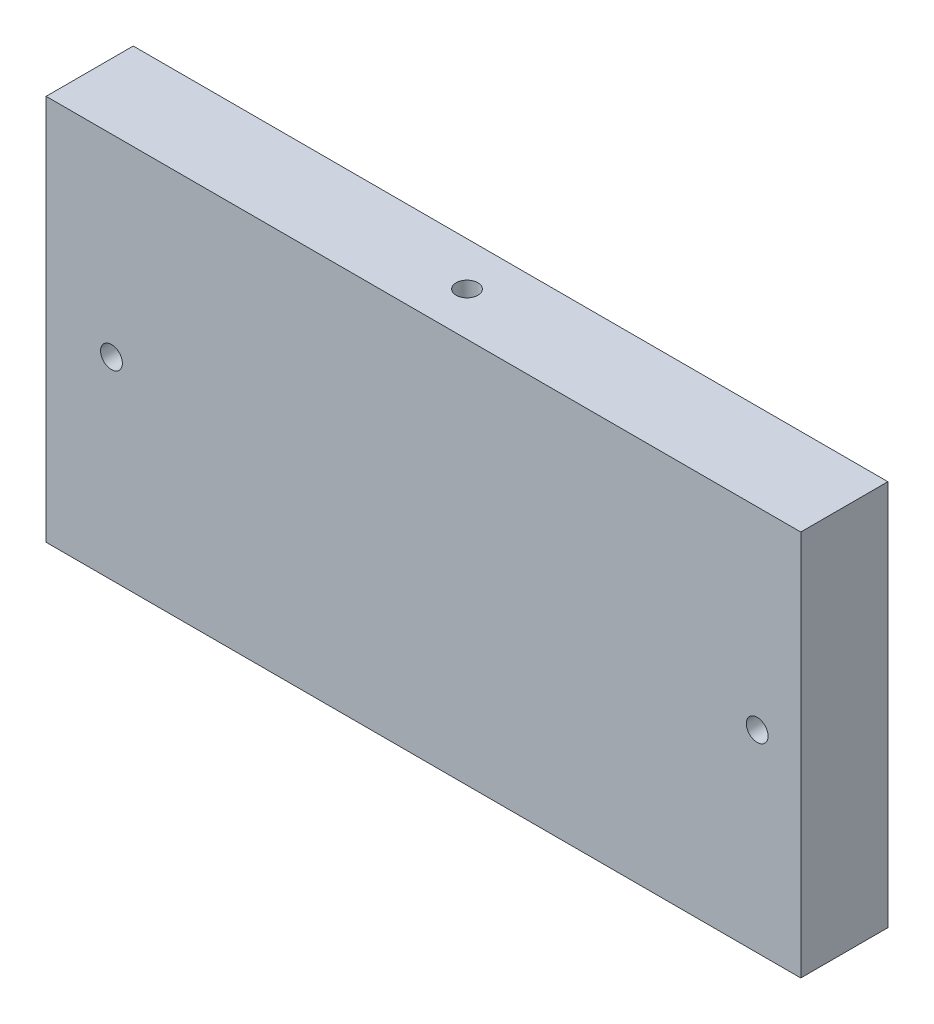
ISO-10303-21;
HEADER;
FILE_DESCRIPTION(('STEP AP214'),'2;1');
FILE_NAME('part.step','',(''),(''),'','','');
FILE_SCHEMA(('AUTOMOTIVE_DESIGN { 1 0 10303 214 1 1 1 1 }'));
ENDSEC;
DATA;
#1=APPLICATION_CONTEXT('core data for automotive mechanical design processes');
#2=APPLICATION_PROTOCOL_DEFINITION('international standard','automotive_design',2000,#1);
#3=PRODUCT_CONTEXT('',#1,'mechanical');
#4=PRODUCT('Part','Part','',(#3));
#5=PRODUCT_RELATED_PRODUCT_CATEGORY('part','',(#4));
#6=PRODUCT_DEFINITION_FORMATION('','',#4);
#7=PRODUCT_DEFINITION_CONTEXT('part definition',#1,'design');
#8=PRODUCT_DEFINITION('design','',#6,#7);
#9=PRODUCT_DEFINITION_SHAPE('','',#8);
#10=(LENGTH_UNIT() NAMED_UNIT(*) SI_UNIT(.MILLI.,.METRE.));
#11=(NAMED_UNIT(*) PLANE_ANGLE_UNIT() SI_UNIT($,.RADIAN.));
#12=(NAMED_UNIT(*) SI_UNIT($,.STERADIAN.) SOLID_ANGLE_UNIT());
#13=UNCERTAINTY_MEASURE_WITH_UNIT(LENGTH_MEASURE(1.E-05),#10,'distance_accuracy_value','');
#14=(GEOMETRIC_REPRESENTATION_CONTEXT(3) GLOBAL_UNCERTAINTY_ASSIGNED_CONTEXT((#13)) GLOBAL_UNIT_ASSIGNED_CONTEXT((#10,
#11,#12)) REPRESENTATION_CONTEXT('',''));
#15=CARTESIAN_POINT('',(0.,0.,0.));
#16=DIRECTION('',(0.,0.,1.));
#17=DIRECTION('',(1.,0.,0.));
#18=AXIS2_PLACEMENT_3D('',#15,#16,#17);
#19=CARTESIAN_POINT('',(-341.304465963193,69.0000000000062,12.699999999999));
#20=DIRECTION('',(0.,1.00000000000005,0.));
#21=DIRECTION('',(0.,0.,-1.00000000000002));
#22=AXIS2_PLACEMENT_3D('',#19,#20,#21);
#23=PLANE('',#22);
#24=CARTESIAN_POINT('',(-286.304465963193,69.0000000000062,6.34999999999853));
#25=DIRECTION('',(0.,-1.00000000000005,0.));
#26=DIRECTION('',(0.,0.,-1.00000000000002));
#27=AXIS2_PLACEMENT_3D('',#24,#25,#26);
#28=CIRCLE('',#27,1.58750000000002);
#29=CARTESIAN_POINT('',(-286.304465963193,69.0000000000062,4.76249999999847));
#30=VERTEX_POINT('',#29);
#31=EDGE_CURVE('E41',#30,#30,#28,.T.);
#32=ORIENTED_EDGE('',*,*,#31,.T.);
#33=EDGE_LOOP('',(#32));
#34=FACE_BOUND('',#33,.T.);
#35=DIRECTION('',(-1.,0.,0.));
#36=VECTOR('',#35,1.);
#37=CARTESIAN_POINT('',(-341.304465963192,69.0000000000071,-1.45890244329649E-12));
#38=LINE('',#37,#36);
#39=CARTESIAN_POINT('',(-231.304465963193,69.0000000000068,-1.24032728532342E-12));
#40=VERTEX_POINT('',#39);
#41=CARTESIAN_POINT('',(-341.304465963192,69.0000000000071,-1.45890244329649E-12));
#42=VERTEX_POINT('',#41);
#43=EDGE_CURVE('E125',#40,#42,#38,.T.);
#44=ORIENTED_EDGE('',*,*,#43,.T.);
#45=DIRECTION('',(0.,0.,-1.00000000000002));
#46=VECTOR('',#45,1.);
#47=CARTESIAN_POINT('',(-341.304465963193,69.0000000000062,12.699999999999));
#48=LINE('',#47,#46);
#49=CARTESIAN_POINT('',(-341.304465963193,69.0000000000062,12.699999999999));
#50=VERTEX_POINT('',#49);
#51=EDGE_CURVE('E124',#50,#42,#48,.T.);
#52=ORIENTED_EDGE('',*,*,#51,.F.);
#53=DIRECTION('',(-1.,0.,0.));
#54=VECTOR('',#53,1.);
#55=CARTESIAN_POINT('',(-341.304465963193,69.0000000000062,12.699999999999));
#56=LINE('',#55,#54);
#57=CARTESIAN_POINT('',(-231.304465963195,69.0000000000064,12.6999999999988));
#58=VERTEX_POINT('',#57);
#59=EDGE_CURVE('E118',#58,#50,#56,.T.);
#60=ORIENTED_EDGE('',*,*,#59,.F.);
#61=DIRECTION('',(0.,0.,-1.00000000000002));
#62=VECTOR('',#61,1.);
#63=CARTESIAN_POINT('',(-231.304465963195,69.0000000000064,12.6999999999988));
#64=LINE('',#63,#62);
#65=EDGE_CURVE('E11',#58,#40,#64,.T.);
#66=ORIENTED_EDGE('',*,*,#65,.T.);
#67=EDGE_LOOP('',(#44,#52,#60,#66));
#68=FACE_BOUND('',#67,.T.);
#69=ADVANCED_FACE('F38',(#34,#68),#23,.T.);
#70=CARTESIAN_POINT('',(-231.304465963195,12.7000000000036,12.7000000000004));
#71=DIRECTION('',(0.999999999999999,0.,0.));
#72=DIRECTION('',(0.,0.,1.00000000000002));
#73=AXIS2_PLACEMENT_3D('',#70,#71,#72);
#74=PLANE('',#73);
#75=DIRECTION('',(0.,1.00000000000005,0.));
#76=VECTOR('',#75,1.);
#77=CARTESIAN_POINT('',(-231.304465963193,12.7000000000006,-2.55004350968591E-13));
#78=LINE('',#77,#76);
#79=CARTESIAN_POINT('',(-231.304465963193,12.7000000000006,-2.55004350968591E-13));
#80=VERTEX_POINT('',#79);
#81=EDGE_CURVE('E80',#80,#40,#78,.T.);
#82=ORIENTED_EDGE('',*,*,#81,.T.);
#83=ORIENTED_EDGE('',*,*,#65,.F.);
#84=DIRECTION('',(0.,1.00000000000005,0.));
#85=VECTOR('',#84,1.);
#86=CARTESIAN_POINT('',(-231.304465963195,12.7000000000036,12.7000000000004));
#87=LINE('',#86,#85);
#88=CARTESIAN_POINT('',(-231.304465963195,12.7000000000036,12.7000000000004));
#89=VERTEX_POINT('',#88);
#90=EDGE_CURVE('E56',#89,#58,#87,.T.);
#91=ORIENTED_EDGE('',*,*,#90,.F.);
#92=DIRECTION('',(0.,0.,-1.00000000000002));
#93=VECTOR('',#92,1.);
#94=CARTESIAN_POINT('',(-231.304465963195,12.7000000000036,12.7000000000004));
#95=LINE('',#94,#93);
#96=EDGE_CURVE('E47',#89,#80,#95,.T.);
#97=ORIENTED_EDGE('',*,*,#96,.T.);
#98=EDGE_LOOP('',(#82,#83,#91,#97));
#99=FACE_BOUND('',#98,.T.);
#100=ADVANCED_FACE('F169',(#99),#74,.T.);
#101=CARTESIAN_POINT('',(-231.304465963195,12.7000000000036,12.7000000000004));
#102=DIRECTION('',(0.,-1.00000000000005,0.));
#103=DIRECTION('',(1.,0.,0.));
#104=AXIS2_PLACEMENT_3D('',#101,#102,#103);
#105=PLANE('',#104);
#106=DIRECTION('',(1.,0.,0.));
#107=VECTOR('',#106,1.);
#108=CARTESIAN_POINT('',(-231.304465963193,12.7000000000006,-2.55004350968591E-13));
#109=LINE('',#108,#107);
#110=CARTESIAN_POINT('',(-341.304465963192,12.6999999999988,-4.04190569902596E-13));
#111=VERTEX_POINT('',#110);
#112=EDGE_CURVE('E74',#111,#80,#109,.T.);
#113=ORIENTED_EDGE('',*,*,#112,.T.);
#114=ORIENTED_EDGE('',*,*,#96,.F.);
#115=DIRECTION('',(1.,0.,0.));
#116=VECTOR('',#115,1.);
#117=CARTESIAN_POINT('',(-231.304465963195,12.7000000000036,12.7000000000004));
#118=LINE('',#117,#116);
#119=CARTESIAN_POINT('',(-341.304465963189,12.7000000000008,12.7000000000002));
#120=VERTEX_POINT('',#119);
#121=EDGE_CURVE('E121',#120,#89,#118,.T.);
#122=ORIENTED_EDGE('',*,*,#121,.F.);
#123=DIRECTION('',(0.,0.,-1.00000000000002));
#124=VECTOR('',#123,1.);
#125=CARTESIAN_POINT('',(-341.304465963189,12.7000000000008,12.7000000000002));
#126=LINE('',#125,#124);
#127=EDGE_CURVE('E133',#120,#111,#126,.T.);
#128=ORIENTED_EDGE('',*,*,#127,.T.);
#129=EDGE_LOOP('',(#113,#114,#122,#128));
#130=FACE_BOUND('',#129,.T.);
#131=ADVANCED_FACE('F155',(#130),#105,.T.);
#132=CARTESIAN_POINT('',(-341.304465963189,12.7000000000008,12.7000000000002));
#133=DIRECTION('',(-0.999999999999999,0.,0.));
#134=DIRECTION('',(0.,0.,-1.00000000000002));
#135=AXIS2_PLACEMENT_3D('',#132,#133,#134);
#136=PLANE('',#135);
#137=DIRECTION('',(0.,-1.00000000000005,0.));
#138=VECTOR('',#137,1.);
#139=CARTESIAN_POINT('',(-341.304465963192,12.6999999999988,-4.04190569902596E-13));
#140=LINE('',#139,#138);
#141=EDGE_CURVE('E128',#42,#111,#140,.T.);
#142=ORIENTED_EDGE('',*,*,#141,.T.);
#143=ORIENTED_EDGE('',*,*,#127,.F.);
#144=DIRECTION('',(0.,-1.00000000000005,0.));
#145=VECTOR('',#144,1.);
#146=CARTESIAN_POINT('',(-341.304465963189,12.7000000000008,12.7000000000002));
#147=LINE('',#146,#145);
#148=EDGE_CURVE('E87',#50,#120,#147,.T.);
#149=ORIENTED_EDGE('',*,*,#148,.F.);
#150=ORIENTED_EDGE('',*,*,#51,.T.);
#151=EDGE_LOOP('',(#142,#143,#149,#150));
#152=FACE_BOUND('',#151,.T.);
#153=ADVANCED_FACE('F146',(#152),#136,.T.);
#154=CARTESIAN_POINT('',(1.11022302462516E-13,0.,12.7000000000002));
#155=DIRECTION('',(0.,0.,-1.00000000000002));
#156=DIRECTION('',(0.999999999999999,0.,0.));
#157=AXIS2_PLACEMENT_3D('',#154,#155,#156);
#158=PLANE('',#157);
#159=CARTESIAN_POINT('',(-237.654465963195,40.8500000000055,12.6999999999995));
#160=DIRECTION('',(0.,0.,1.00000000000002));
#161=DIRECTION('',(0.999999999999999,0.,0.));
#162=AXIS2_PLACEMENT_3D('',#159,#160,#161);
#163=CIRCLE('',#162,1.58749999999999);
#164=CARTESIAN_POINT('',(-236.066965963195,40.8500000000055,12.6999999999995));
#165=VERTEX_POINT('',#164);
#166=EDGE_CURVE('E110',#165,#165,#163,.T.);
#167=ORIENTED_EDGE('',*,*,#166,.F.);
#168=EDGE_LOOP('',(#167));
#169=FACE_BOUND('',#168,.T.);
#170=CARTESIAN_POINT('',(-331.779465963192,40.8500000000054,12.6999999999997));
#171=DIRECTION('',(0.,0.,1.00000000000002));
#172=DIRECTION('',(0.999999999999999,0.,0.));
#173=AXIS2_PLACEMENT_3D('',#170,#171,#172);
#174=CIRCLE('',#173,1.58750000000002);
#175=CARTESIAN_POINT('',(-330.191965963192,40.8500000000054,12.6999999999997));
#176=VERTEX_POINT('',#175);
#177=EDGE_CURVE('E117',#176,#176,#174,.T.);
#178=ORIENTED_EDGE('',*,*,#177,.F.);
#179=EDGE_LOOP('',(#178));
#180=FACE_BOUND('',#179,.T.);
#181=ORIENTED_EDGE('',*,*,#59,.T.);
#182=ORIENTED_EDGE('',*,*,#148,.T.);
#183=ORIENTED_EDGE('',*,*,#121,.T.);
#184=ORIENTED_EDGE('',*,*,#90,.T.);
#185=EDGE_LOOP('',(#181,#182,#183,#184));
#186=FACE_BOUND('',#185,.T.);
#187=ADVANCED_FACE('F142',(#169,#180,#186),#158,.F.);
#188=CARTESIAN_POINT('',(0.,0.,0.));
#189=DIRECTION('',(0.,0.,-1.00000000000002));
#190=DIRECTION('',(0.999999999999999,0.,0.));
#191=AXIS2_PLACEMENT_3D('',#188,#189,#190);
#192=PLANE('',#191);
#193=CARTESIAN_POINT('',(-237.654465963193,40.850000000006,-8.15320033709099E-13));
#194=DIRECTION('',(0.,0.,1.00000000000002));
#195=DIRECTION('',(0.999999999999999,0.,0.));
#196=AXIS2_PLACEMENT_3D('',#193,#194,#195);
#197=CIRCLE('',#196,5.08);
#198=CARTESIAN_POINT('',(-232.574465963193,40.850000000006,-8.11090083996475E-13));
#199=VERTEX_POINT('',#198);
#200=EDGE_CURVE('E103',#199,#199,#197,.T.);
#201=ORIENTED_EDGE('',*,*,#200,.T.);
#202=EDGE_LOOP('',(#201));
#203=FACE_BOUND('',#202,.T.);
#204=CARTESIAN_POINT('',(-331.779465963196,40.8500000000056,-8.46545056276682E-13));
#205=DIRECTION('',(0.,0.,1.00000000000002));
#206=DIRECTION('',(0.999999999999999,0.,0.));
#207=AXIS2_PLACEMENT_3D('',#204,#205,#206);
#208=CIRCLE('',#207,5.08000000000003);
#209=CARTESIAN_POINT('',(-326.699465963196,40.8500000000056,-8.42315106556977E-13));
#210=VERTEX_POINT('',#209);
#211=EDGE_CURVE('E111',#210,#210,#208,.T.);
#212=ORIENTED_EDGE('',*,*,#211,.T.);
#213=EDGE_LOOP('',(#212));
#214=FACE_BOUND('',#213,.T.);
#215=ORIENTED_EDGE('',*,*,#43,.F.);
#216=ORIENTED_EDGE('',*,*,#81,.F.);
#217=ORIENTED_EDGE('',*,*,#112,.F.);
#218=ORIENTED_EDGE('',*,*,#141,.F.);
#219=EDGE_LOOP('',(#215,#216,#217,#218));
#220=FACE_BOUND('',#219,.T.);
#221=ADVANCED_FACE('F145',(#203,#214,#220),#192,.T.);
#222=CARTESIAN_POINT('',(-331.779465963196,40.8500000000056,-8.46545056276682E-13));
#223=DIRECTION('',(0.,0.,-1.00000000000002));
#224=DIRECTION('',(0.999999999999999,0.,0.));
#225=AXIS2_PLACEMENT_3D('',#222,#223,#224);
#226=CYLINDRICAL_SURFACE('',#225,1.58750000000002);
#227=CARTESIAN_POINT('',(-331.779465963197,40.8500000000054,4.01766166221864));
#228=DIRECTION('',(0.,0.,1.00000000000002));
#229=DIRECTION('',(0.999999999999999,0.,0.));
#230=AXIS2_PLACEMENT_3D('',#227,#228,#229);
#231=CIRCLE('',#230,1.58750000000002);
#232=CARTESIAN_POINT('',(-330.191965963196,40.8500000000055,4.01766166221864));
#233=VERTEX_POINT('',#232);
#234=EDGE_CURVE('E114',#233,#233,#231,.T.);
#235=ORIENTED_EDGE('',*,*,#234,.F.);
#236=EDGE_LOOP('',(#235));
#237=FACE_BOUND('',#236,.T.);
#238=ORIENTED_EDGE('',*,*,#177,.T.);
#239=EDGE_LOOP('',(#238));
#240=FACE_BOUND('',#239,.T.);
#241=ADVANCED_FACE('F157',(#237,#240),#226,.F.);
#242=CARTESIAN_POINT('',(-331.779465963196,40.8500000000056,-8.46545056276682E-13));
#243=DIRECTION('',(0.,0.,-1.00000000000002));
#244=DIRECTION('',(0.999999999999999,0.,0.));
#245=AXIS2_PLACEMENT_3D('',#242,#243,#244);
#246=CONICAL_SURFACE('',#245,5.08000000000003,0.715584993317678);
#247=CARTESIAN_POINT('',(-330.191965963196,40.8500000000055,4.01766166221864));
#248=CARTESIAN_POINT('',(-330.155585754863,40.8500000000055,3.97581101990387));
#249=CARTESIAN_POINT('',(-330.11920554653,40.8500000000055,3.93396037758908));
#250=CARTESIAN_POINT('',(-330.046445129863,40.8500000000055,3.85025909295949));
#251=CARTESIAN_POINT('',(-330.01006492153,40.8500000000055,3.8084084506447));
#252=CARTESIAN_POINT('',(-329.937304504863,40.8500000000055,3.72470716601513));
#253=CARTESIAN_POINT('',(-329.90092429653,40.8500000000055,3.68285652370035));
#254=CARTESIAN_POINT('',(-329.828163879863,40.8500000000055,3.59915523907078));
#255=CARTESIAN_POINT('',(-329.79178367153,40.8500000000055,3.55730459675599));
#256=CARTESIAN_POINT('',(-329.719023254863,40.8500000000055,3.47360331212642));
#257=CARTESIAN_POINT('',(-329.68264304653,40.8500000000055,3.43175266981163));
#258=CARTESIAN_POINT('',(-329.609882629863,40.8500000000055,3.34805138518206));
#259=CARTESIAN_POINT('',(-329.57350242153,40.8500000000055,3.30620074286727));
#260=CARTESIAN_POINT('',(-329.500742004863,40.8500000000055,3.2224994582377));
#261=CARTESIAN_POINT('',(-329.46436179653,40.8500000000055,3.18064881592291));
#262=CARTESIAN_POINT('',(-329.391601379863,40.8500000000055,3.09694753129334));
#263=CARTESIAN_POINT('',(-329.35522117153,40.8500000000055,3.05509688897856));
#264=CARTESIAN_POINT('',(-329.282460754863,40.8500000000055,2.97139560434898));
#265=CARTESIAN_POINT('',(-329.24608054653,40.8500000000055,2.9295449620342));
#266=CARTESIAN_POINT('',(-329.173320129863,40.8500000000055,2.84584367740462));
#267=CARTESIAN_POINT('',(-329.13693992153,40.8500000000055,2.80399303508984));
#268=CARTESIAN_POINT('',(-329.064179504863,40.8500000000055,2.72029175046026));
#269=CARTESIAN_POINT('',(-329.02779929653,40.8500000000055,2.67844110814548));
#270=CARTESIAN_POINT('',(-328.955038879863,40.8500000000055,2.59473982351591));
#271=CARTESIAN_POINT('',(-328.91865867153,40.8500000000055,2.55288918120112));
#272=CARTESIAN_POINT('',(-328.845898254863,40.8500000000055,2.46918789657155));
#273=CARTESIAN_POINT('',(-328.80951804653,40.8500000000055,2.42733725425676));
#274=CARTESIAN_POINT('',(-328.736757629863,40.8500000000055,2.34363596962719));
#275=CARTESIAN_POINT('',(-328.70037742153,40.8500000000055,2.3017853273124));
#276=CARTESIAN_POINT('',(-328.627617004863,40.8500000000055,2.21808404268283));
#277=CARTESIAN_POINT('',(-328.59123679653,40.8500000000055,2.17623340036804));
#278=CARTESIAN_POINT('',(-328.518476379863,40.8500000000055,2.09253211573847));
#279=CARTESIAN_POINT('',(-328.48209617153,40.8500000000055,2.05068147342368));
#280=CARTESIAN_POINT('',(-328.409335754863,40.8500000000055,1.96698018879411));
#281=CARTESIAN_POINT('',(-328.37295554653,40.8500000000055,1.92512954647933));
#282=CARTESIAN_POINT('',(-328.300195129863,40.8500000000055,1.84142826184975));
#283=CARTESIAN_POINT('',(-328.26381492153,40.8500000000055,1.79957761953497));
#284=CARTESIAN_POINT('',(-328.191054504863,40.8500000000055,1.7158763349054));
#285=CARTESIAN_POINT('',(-328.15467429653,40.8500000000055,1.67402569259061));
#286=CARTESIAN_POINT('',(-328.081913879863,40.8500000000055,1.59032440796104));
#287=CARTESIAN_POINT('',(-328.04553367153,40.8500000000055,1.54847376564625));
#288=CARTESIAN_POINT('',(-327.972773254863,40.8500000000055,1.46477248101667));
#289=CARTESIAN_POINT('',(-327.93639304653,40.8500000000055,1.42292183870189));
#290=CARTESIAN_POINT('',(-327.863632629863,40.8500000000055,1.33922055407232));
#291=CARTESIAN_POINT('',(-327.82725242153,40.8500000000056,1.29736991175753));
#292=CARTESIAN_POINT('',(-327.754492004863,40.8500000000056,1.21366862712796));
#293=CARTESIAN_POINT('',(-327.71811179653,40.8500000000056,1.17181798481317));
#294=CARTESIAN_POINT('',(-327.645351379863,40.8500000000056,1.0881167001836));
#295=CARTESIAN_POINT('',(-327.60897117153,40.8500000000056,1.04626605786881));
#296=CARTESIAN_POINT('',(-327.536210754863,40.8500000000056,0.962564773239242));
#297=CARTESIAN_POINT('',(-327.49983054653,40.8500000000056,0.920714130924456));
#298=CARTESIAN_POINT('',(-327.427070129863,40.8500000000056,0.837012846294883));
#299=CARTESIAN_POINT('',(-327.39068992153,40.8500000000056,0.795162203980097));
#300=CARTESIAN_POINT('',(-327.317929504863,40.8500000000056,0.711460919350524));
#301=CARTESIAN_POINT('',(-327.28154929653,40.8500000000056,0.669610277035738));
#302=CARTESIAN_POINT('',(-327.208788879863,40.8500000000056,0.585908992406165));
#303=CARTESIAN_POINT('',(-327.17240867153,40.8500000000056,0.544058350091379));
#304=CARTESIAN_POINT('',(-327.099648254863,40.8500000000056,0.460357065461807));
#305=CARTESIAN_POINT('',(-327.06326804653,40.8500000000056,0.41850642314702));
#306=CARTESIAN_POINT('',(-326.990507629863,40.8500000000056,0.334805138517448));
#307=CARTESIAN_POINT('',(-326.95412742153,40.8500000000056,0.292954496202662));
#308=CARTESIAN_POINT('',(-326.881367004863,40.8500000000056,0.209253211573089));
#309=CARTESIAN_POINT('',(-326.84498679653,40.8500000000056,0.167402569258303));
#310=CARTESIAN_POINT('',(-326.772226379863,40.8500000000056,0.0837012846287303));
#311=CARTESIAN_POINT('',(-326.73584617153,40.8500000000056,0.0418506423139441));
#312=CARTESIAN_POINT('',(-326.699465963196,40.8500000000056,-8.42144132207068E-13));
#313=B_SPLINE_CURVE_WITH_KNOTS('',3,(#247,#248,#249,#250,#251,#252,#253,#254,#255,#256,#257,
#258,#259,#260,#261,#262,#263,#264,#265,#266,#267,#268,#269,#270,#271,#272,#273,#274,#275,#276,
#277,#278,#279,#280,#281,#282,#283,#284,#285,#286,#287,#288,#289,#290,#291,#292,#293,#294,#295,
#296,#297,#298,#299,#300,#301,#302,#303,#304,#305,#306,#307,#308,#309,#310,#311,#312),
.UNSPECIFIED.,.F.,.F.,(4,2,2,2,2,2,2,2,2,2,2,2,2,2,2,2,2,2,2,2,2,2,2,2,2,2,2,2,2,2,2,2,4),(0.,
0.166357934541257,0.332715869082477,0.499073803623734,0.66543173816499,0.831789672706247,
0.998147607247504,1.16450554178876,1.33086347633002,1.49722141087127,1.66357934541253,
1.82993727995379,1.99629521449504,2.1626531490363,2.32901108357756,2.49536901811881,
2.66172695266007,2.82808488720133,2.99444282174258,3.16080075628384,3.32715869082506,
3.49351662536632,3.65987455990757,3.82623249444883,3.99259042899009,4.15894836353135,
4.3253062980726,4.49166423261386,4.65802216715511,4.82438010169637,4.99073803623763,
5.15709597077888,5.32345390532014),.UNSPECIFIED.);
#314=EDGE_CURVE('BSEAM163',#233,#210,#313,.T.);
#315=ORIENTED_EDGE('',*,*,#234,.T.);
#316=ORIENTED_EDGE('',*,*,#211,.F.);
#317=ORIENTED_EDGE('',*,*,#314,.T.);
#318=ORIENTED_EDGE('',*,*,#314,.F.);
#319=EDGE_LOOP('',(#315,#317,#316,#318));
#320=FACE_BOUND('',#319,.T.);
#321=ADVANCED_FACE('F163',(#320),#246,.F.);
#322=CARTESIAN_POINT('',(-237.654465963193,40.850000000006,-8.15320033709099E-13));
#323=DIRECTION('',(0.,0.,-1.00000000000002));
#324=DIRECTION('',(0.999999999999999,0.,0.));
#325=AXIS2_PLACEMENT_3D('',#322,#323,#324);
#326=CYLINDRICAL_SURFACE('',#325,1.58749999999999);
#327=CARTESIAN_POINT('',(-237.654465963193,40.8500000000059,4.01766166221864));
#328=DIRECTION('',(0.,0.,1.00000000000002));
#329=DIRECTION('',(0.999999999999999,0.,0.));
#330=AXIS2_PLACEMENT_3D('',#327,#328,#329);
#331=CIRCLE('',#330,1.58749999999999);
#332=CARTESIAN_POINT('',(-236.066965963193,40.8500000000059,4.01766166221864));
#333=VERTEX_POINT('',#332);
#334=EDGE_CURVE('E107',#333,#333,#331,.T.);
#335=ORIENTED_EDGE('',*,*,#334,.F.);
#336=EDGE_LOOP('',(#335));
#337=FACE_BOUND('',#336,.T.);
#338=ORIENTED_EDGE('',*,*,#166,.T.);
#339=EDGE_LOOP('',(#338));
#340=FACE_BOUND('',#339,.T.);
#341=ADVANCED_FACE('F140',(#337,#340),#326,.F.);
#342=CARTESIAN_POINT('',(-237.654465963193,40.850000000006,-8.15320033709099E-13));
#343=DIRECTION('',(0.,0.,-1.00000000000002));
#344=DIRECTION('',(0.999999999999999,0.,0.));
#345=AXIS2_PLACEMENT_3D('',#342,#343,#344);
#346=CONICAL_SURFACE('',#345,5.08,0.715584993317678);
#347=CARTESIAN_POINT('',(-236.066965963193,40.8500000000059,4.01766166221864));
#348=CARTESIAN_POINT('',(-236.030585754859,40.8500000000059,3.97581101990385));
#349=CARTESIAN_POINT('',(-235.994205546526,40.8500000000059,3.93396037758907));
#350=CARTESIAN_POINT('',(-235.921445129859,40.8500000000059,3.8502590929595));
#351=CARTESIAN_POINT('',(-235.885064921526,40.8500000000059,3.80840845064471));
#352=CARTESIAN_POINT('',(-235.812304504859,40.8500000000059,3.72470716601514));
#353=CARTESIAN_POINT('',(-235.775924296526,40.8500000000059,3.68285652370035));
#354=CARTESIAN_POINT('',(-235.703163879859,40.8500000000059,3.59915523907078));
#355=CARTESIAN_POINT('',(-235.666783671526,40.8500000000059,3.557304596756));
#356=CARTESIAN_POINT('',(-235.594023254859,40.8500000000059,3.47360331212642));
#357=CARTESIAN_POINT('',(-235.557643046526,40.8500000000059,3.43175266981164));
#358=CARTESIAN_POINT('',(-235.484882629859,40.8500000000059,3.34805138518206));
#359=CARTESIAN_POINT('',(-235.448502421526,40.8500000000059,3.30620074286728));
#360=CARTESIAN_POINT('',(-235.375742004859,40.8500000000059,3.22249945823771));
#361=CARTESIAN_POINT('',(-235.339361796526,40.8500000000059,3.18064881592292));
#362=CARTESIAN_POINT('',(-235.266601379859,40.8500000000059,3.09694753129335));
#363=CARTESIAN_POINT('',(-235.230221171526,40.8500000000059,3.05509688897856));
#364=CARTESIAN_POINT('',(-235.157460754859,40.8500000000059,2.97139560434899));
#365=CARTESIAN_POINT('',(-235.121080546526,40.8500000000059,2.92954496203421));
#366=CARTESIAN_POINT('',(-235.048320129859,40.8500000000059,2.84584367740463));
#367=CARTESIAN_POINT('',(-235.011939921526,40.8500000000059,2.80399303508985));
#368=CARTESIAN_POINT('',(-234.939179504859,40.8500000000059,2.72029175046028));
#369=CARTESIAN_POINT('',(-234.902799296526,40.8500000000059,2.67844110814549));
#370=CARTESIAN_POINT('',(-234.830038879859,40.8500000000059,2.59473982351592));
#371=CARTESIAN_POINT('',(-234.793658671526,40.8500000000059,2.55288918120113));
#372=CARTESIAN_POINT('',(-234.720898254859,40.8500000000059,2.46918789657156));
#373=CARTESIAN_POINT('',(-234.684518046526,40.8500000000059,2.42733725425677));
#374=CARTESIAN_POINT('',(-234.611757629859,40.8500000000059,2.3436359696272));
#375=CARTESIAN_POINT('',(-234.575377421526,40.8500000000059,2.30178532731242));
#376=CARTESIAN_POINT('',(-234.502617004859,40.8500000000059,2.21808404268284));
#377=CARTESIAN_POINT('',(-234.466236796526,40.8500000000059,2.17623340036806));
#378=CARTESIAN_POINT('',(-234.393476379859,40.8500000000059,2.09253211573849));
#379=CARTESIAN_POINT('',(-234.357096171526,40.8500000000059,2.0506814734237));
#380=CARTESIAN_POINT('',(-234.284335754859,40.8500000000059,1.96698018879413));
#381=CARTESIAN_POINT('',(-234.247955546526,40.8500000000059,1.92512954647934));
#382=CARTESIAN_POINT('',(-234.175195129859,40.8500000000059,1.84142826184977));
#383=CARTESIAN_POINT('',(-234.138814921526,40.8500000000059,1.79957761953499));
#384=CARTESIAN_POINT('',(-234.066054504859,40.8500000000059,1.71587633490541));
#385=CARTESIAN_POINT('',(-234.029674296526,40.8500000000059,1.67402569259063));
#386=CARTESIAN_POINT('',(-233.956913879859,40.8500000000059,1.59032440796105));
#387=CARTESIAN_POINT('',(-233.920533671526,40.850000000006,1.54847376564627));
#388=CARTESIAN_POINT('',(-233.847773254859,40.850000000006,1.4647724810167));
#389=CARTESIAN_POINT('',(-233.811393046526,40.850000000006,1.42292183870191));
#390=CARTESIAN_POINT('',(-233.738632629859,40.850000000006,1.33922055407234));
#391=CARTESIAN_POINT('',(-233.702252421526,40.850000000006,1.29736991175755));
#392=CARTESIAN_POINT('',(-233.629492004859,40.850000000006,1.21366862712798));
#393=CARTESIAN_POINT('',(-233.593111796526,40.850000000006,1.1718179848132));
#394=CARTESIAN_POINT('',(-233.520351379859,40.850000000006,1.08811670018362));
#395=CARTESIAN_POINT('',(-233.483971171526,40.850000000006,1.04626605786884));
#396=CARTESIAN_POINT('',(-233.411210754859,40.850000000006,0.962564773239267));
#397=CARTESIAN_POINT('',(-233.374830546526,40.850000000006,0.920714130924483));
#398=CARTESIAN_POINT('',(-233.302070129859,40.850000000006,0.83701284629491));
#399=CARTESIAN_POINT('',(-233.265689921526,40.850000000006,0.79516220398012));
#400=CARTESIAN_POINT('',(-233.192929504859,40.850000000006,0.711460919350547));
#401=CARTESIAN_POINT('',(-233.156549296526,40.850000000006,0.669610277035763));
#402=CARTESIAN_POINT('',(-233.083788879859,40.850000000006,0.585908992406193));
#403=CARTESIAN_POINT('',(-233.047408671526,40.850000000006,0.544058350091407));
#404=CARTESIAN_POINT('',(-232.974648254859,40.850000000006,0.460357065461835));
#405=CARTESIAN_POINT('',(-232.938268046526,40.850000000006,0.418506423147049));
#406=CARTESIAN_POINT('',(-232.865507629859,40.850000000006,0.334805138517477));
#407=CARTESIAN_POINT('',(-232.829127421526,40.850000000006,0.292954496202691));
#408=CARTESIAN_POINT('',(-232.756367004859,40.850000000006,0.209253211573119));
#409=CARTESIAN_POINT('',(-232.719986796526,40.850000000006,0.167402569258333));
#410=CARTESIAN_POINT('',(-232.647226379859,40.850000000006,0.083701284628761));
#411=CARTESIAN_POINT('',(-232.610846171526,40.850000000006,0.0418506423139751));
#412=CARTESIAN_POINT('',(-232.574465963193,40.850000000006,-8.10919109639485E-13));
#413=B_SPLINE_CURVE_WITH_KNOTS('',3,(#347,#348,#349,#350,#351,#352,#353,#354,#355,#356,#357,
#358,#359,#360,#361,#362,#363,#364,#365,#366,#367,#368,#369,#370,#371,#372,#373,#374,#375,#376,
#377,#378,#379,#380,#381,#382,#383,#384,#385,#386,#387,#388,#389,#390,#391,#392,#393,#394,#395,
#396,#397,#398,#399,#400,#401,#402,#403,#404,#405,#406,#407,#408,#409,#410,#411,#412),
.UNSPECIFIED.,.F.,.F.,(4,2,2,2,2,2,2,2,2,2,2,2,2,2,2,2,2,2,2,2,2,2,2,2,2,2,2,2,2,2,2,2,4),(0.,
0.166357934541256,0.332715869082512,0.499073803623768,0.665431738165024,0.831789672706262,
0.998147607247518,1.16450554178877,1.33086347633003,1.49722141087129,1.66357934541254,
1.8299372799538,1.99629521449504,2.16265314903629,2.32901108357755,2.4953690181188,
2.66172695266006,2.82808488720131,2.99444282174257,3.16080075628381,3.32715869082506,
3.49351662536632,3.65987455990758,3.82623249444883,3.99259042899009,4.15894836353134,
4.32530629807258,4.49166423261384,4.65802216715509,4.82438010169635,4.9907380362376,
5.15709597077886,5.32345390532012),.UNSPECIFIED.);
#414=EDGE_CURVE('BSEAM95',#333,#199,#413,.T.);
#415=ORIENTED_EDGE('',*,*,#334,.T.);
#416=ORIENTED_EDGE('',*,*,#200,.F.);
#417=ORIENTED_EDGE('',*,*,#414,.T.);
#418=ORIENTED_EDGE('',*,*,#414,.F.);
#419=EDGE_LOOP('',(#415,#417,#416,#418));
#420=FACE_BOUND('',#419,.T.);
#421=ADVANCED_FACE('F95',(#420),#346,.F.);
#422=CARTESIAN_POINT('',(-286.304465963193,56.3000000000053,6.34999999999885));
#423=DIRECTION('',(0.,1.00000000000005,0.));
#424=DIRECTION('',(0.,0.,-1.00000000000002));
#425=AXIS2_PLACEMENT_3D('',#422,#423,#424);
#426=CONICAL_SURFACE('',#425,1.58750000000002,1.02974425867666);
#427=CARTESIAN_POINT('',(-286.304465963193,55.3461337672992,6.34999999999893));
#428=VERTEX_POINT('',#427);
#429=VERTEX_LOOP('',#428);
#430=FACE_BOUND('',#429,.T.);
#431=CARTESIAN_POINT('',(-286.304465963193,56.3000000000053,6.34999999999885));
#432=DIRECTION('',(0.,-1.00000000000005,0.));
#433=DIRECTION('',(0.,0.,-1.00000000000002));
#434=AXIS2_PLACEMENT_3D('',#431,#432,#433);
#435=CIRCLE('',#434,1.58750000000002);
#436=CARTESIAN_POINT('',(-286.304465963193,56.3000000000053,4.7624999999988));
#437=VERTEX_POINT('',#436);
#438=EDGE_CURVE('E99',#437,#437,#435,.T.);
#439=ORIENTED_EDGE('',*,*,#438,.F.);
#440=EDGE_LOOP('',(#439));
#441=FACE_BOUND('',#440,.T.);
#442=ADVANCED_FACE('F91',(#430,#441),#426,.F.);
#443=CARTESIAN_POINT('',(-286.304465963193,88.0500000000065,6.34999999999781));
#444=DIRECTION('',(0.,1.00000000000005,0.));
#445=DIRECTION('',(0.,0.,-1.00000000000002));
#446=AXIS2_PLACEMENT_3D('',#443,#444,#445);
#447=CYLINDRICAL_SURFACE('',#446,1.58750000000002);
#448=ORIENTED_EDGE('',*,*,#31,.F.);
#449=EDGE_LOOP('',(#448));
#450=FACE_BOUND('',#449,.T.);
#451=ORIENTED_EDGE('',*,*,#438,.T.);
#452=EDGE_LOOP('',(#451));
#453=FACE_BOUND('',#452,.T.);
#454=ADVANCED_FACE('F94',(#450,#453),#447,.F.);
#455=CLOSED_SHELL('',(#69,#100,#131,#153,#187,#221,#241,#321,#341,#421,#442,#454));
#456=MANIFOLD_SOLID_BREP('B2',#455);
#457=ADVANCED_BREP_SHAPE_REPRESENTATION('',(#18,#456),#14);
#458=SHAPE_DEFINITION_REPRESENTATION(#9,#457);
ENDSEC;
END-ISO-10303-21;
